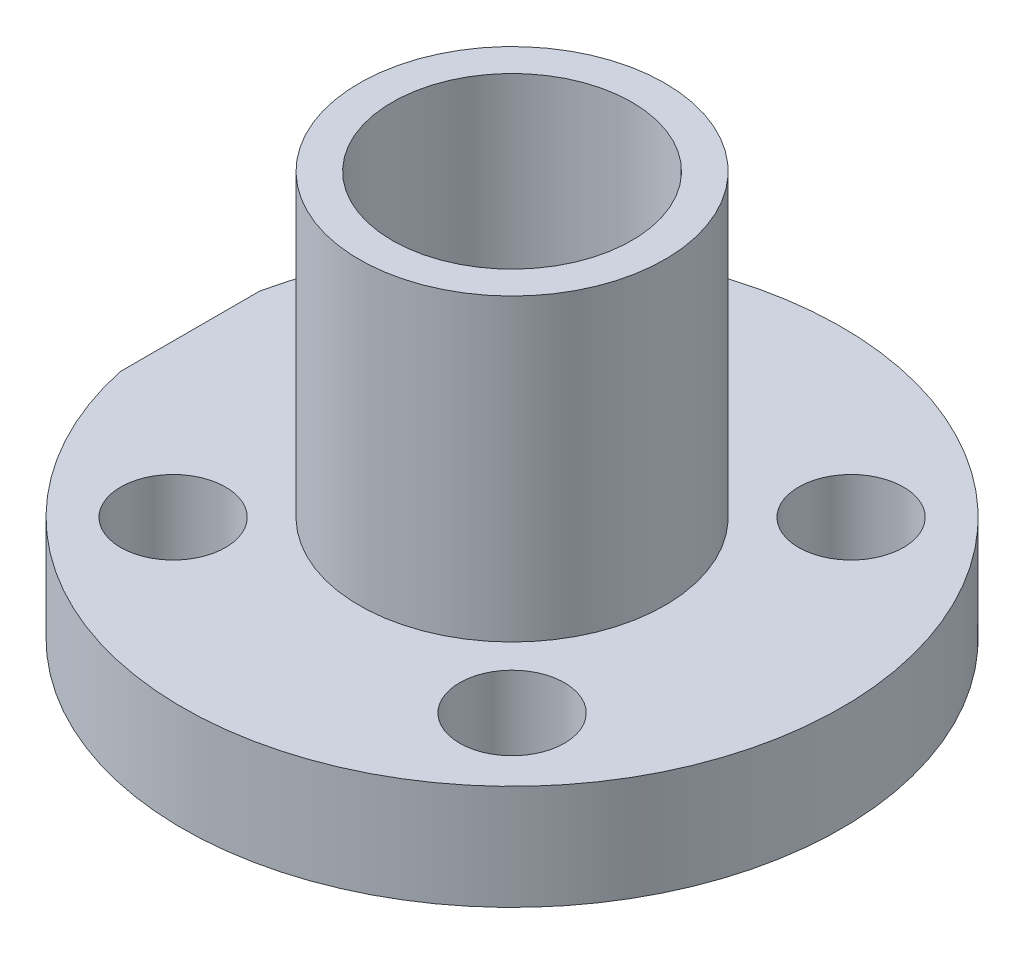
ISO-10303-21;
HEADER;
FILE_DESCRIPTION(('STEP AP214'),'2;1');
FILE_NAME('part.step','',(''),(''),'','','');
FILE_SCHEMA(('AUTOMOTIVE_DESIGN { 1 0 10303 214 1 1 1 1 }'));
ENDSEC;
DATA;
#1=APPLICATION_CONTEXT('core data for automotive mechanical design processes');
#2=APPLICATION_PROTOCOL_DEFINITION('international standard','automotive_design',2000,#1);
#3=PRODUCT_CONTEXT('',#1,'mechanical');
#4=PRODUCT('Part','Part','',(#3));
#5=PRODUCT_RELATED_PRODUCT_CATEGORY('part','',(#4));
#6=PRODUCT_DEFINITION_FORMATION('','',#4);
#7=PRODUCT_DEFINITION_CONTEXT('part definition',#1,'design');
#8=PRODUCT_DEFINITION('design','',#6,#7);
#9=PRODUCT_DEFINITION_SHAPE('','',#8);
#10=(LENGTH_UNIT() NAMED_UNIT(*) SI_UNIT(.MILLI.,.METRE.));
#11=(NAMED_UNIT(*) PLANE_ANGLE_UNIT() SI_UNIT($,.RADIAN.));
#12=(NAMED_UNIT(*) SI_UNIT($,.STERADIAN.) SOLID_ANGLE_UNIT());
#13=UNCERTAINTY_MEASURE_WITH_UNIT(LENGTH_MEASURE(1.E-05),#10,'distance_accuracy_value','');
#14=(GEOMETRIC_REPRESENTATION_CONTEXT(3) GLOBAL_UNCERTAINTY_ASSIGNED_CONTEXT((#13)) GLOBAL_UNIT_ASSIGNED_CONTEXT((#10,
#11,#12)) REPRESENTATION_CONTEXT('',''));
#15=CARTESIAN_POINT('',(0.,0.,0.));
#16=DIRECTION('',(0.,0.,1.));
#17=DIRECTION('',(1.,0.,0.));
#18=AXIS2_PLACEMENT_3D('',#15,#16,#17);
#19=CARTESIAN_POINT('',(0.,0.,0.));
#20=DIRECTION('',(0.,-1.,0.));
#21=DIRECTION('',(0.,0.,-1.));
#22=AXIS2_PLACEMENT_3D('',#19,#20,#21);
#23=CYLINDRICAL_SURFACE('',#22,4.);
#24=CARTESIAN_POINT('',(0.,13.5,0.));
#25=DIRECTION('',(0.,-1.,0.));
#26=DIRECTION('',(0.,0.,-1.));
#27=AXIS2_PLACEMENT_3D('',#24,#25,#26);
#28=CIRCLE('',#27,4.);
#29=CARTESIAN_POINT('',(0.,13.5,-4.));
#30=VERTEX_POINT('',#29);
#31=EDGE_CURVE('E42',#30,#30,#28,.T.);
#32=ORIENTED_EDGE('',*,*,#31,.F.);
#33=EDGE_LOOP('',(#32));
#34=FACE_BOUND('',#33,.T.);
#35=CARTESIAN_POINT('',(0.,-1.5,0.));
#36=DIRECTION('',(0.,-1.,0.));
#37=DIRECTION('',(0.,0.,-1.));
#38=AXIS2_PLACEMENT_3D('',#35,#36,#37);
#39=CIRCLE('',#38,4.);
#40=CARTESIAN_POINT('',(0.,-1.5,-4.));
#41=VERTEX_POINT('',#40);
#42=EDGE_CURVE('E114',#41,#41,#39,.T.);
#43=ORIENTED_EDGE('',*,*,#42,.T.);
#44=EDGE_LOOP('',(#43));
#45=FACE_BOUND('',#44,.T.);
#46=ADVANCED_FACE('F35',(#34,#45),#23,.F.);
#47=CARTESIAN_POINT('',(-4.,13.5,0.));
#48=DIRECTION('',(0.,-1.,0.));
#49=DIRECTION('',(0.,0.,-1.));
#50=AXIS2_PLACEMENT_3D('',#47,#48,#49);
#51=PLANE('',#50);
#52=CARTESIAN_POINT('',(0.,13.5,0.));
#53=DIRECTION('',(0.,-1.,0.));
#54=DIRECTION('',(0.,0.,-1.));
#55=AXIS2_PLACEMENT_3D('',#52,#53,#54);
#56=CIRCLE('',#55,5.1);
#57=CARTESIAN_POINT('',(0.,13.5,-5.1));
#58=VERTEX_POINT('',#57);
#59=EDGE_CURVE('E77',#58,#58,#56,.T.);
#60=ORIENTED_EDGE('',*,*,#59,.F.);
#61=EDGE_LOOP('',(#60));
#62=FACE_BOUND('',#61,.T.);
#63=ORIENTED_EDGE('',*,*,#31,.T.);
#64=EDGE_LOOP('',(#63));
#65=FACE_BOUND('',#64,.T.);
#66=ADVANCED_FACE('F139',(#62,#65),#51,.F.);
#67=CARTESIAN_POINT('',(0.,0.,0.));
#68=DIRECTION('',(0.,-1.,0.));
#69=DIRECTION('',(0.,0.,-1.));
#70=AXIS2_PLACEMENT_3D('',#67,#68,#69);
#71=CYLINDRICAL_SURFACE('',#70,5.1);
#72=CARTESIAN_POINT('',(0.,3.5,0.));
#73=DIRECTION('',(0.,-1.,0.));
#74=DIRECTION('',(0.,0.,-1.));
#75=AXIS2_PLACEMENT_3D('',#72,#73,#74);
#76=CIRCLE('',#75,5.1);
#77=CARTESIAN_POINT('',(0.,3.5,-5.1));
#78=VERTEX_POINT('',#77);
#79=EDGE_CURVE('E73',#78,#78,#76,.T.);
#80=ORIENTED_EDGE('',*,*,#79,.F.);
#81=EDGE_LOOP('',(#80));
#82=FACE_BOUND('',#81,.T.);
#83=ORIENTED_EDGE('',*,*,#59,.T.);
#84=EDGE_LOOP('',(#83));
#85=FACE_BOUND('',#84,.T.);
#86=ADVANCED_FACE('F144',(#82,#85),#71,.T.);
#87=CARTESIAN_POINT('',(-5.1,3.5,0.));
#88=DIRECTION('',(0.,-1.,0.));
#89=DIRECTION('',(0.,0.,-1.));
#90=AXIS2_PLACEMENT_3D('',#87,#88,#89);
#91=PLANE('',#90);
#92=CARTESIAN_POINT('',(-5.65685424949238,3.5,-5.65685424949238));
#93=DIRECTION('',(0.,1.,0.));
#94=DIRECTION('',(0.,0.,1.));
#95=AXIS2_PLACEMENT_3D('',#92,#93,#94);
#96=CIRCLE('',#95,1.75);
#97=CARTESIAN_POINT('',(-5.65685424949238,3.5,-3.90685424949238));
#98=VERTEX_POINT('',#97);
#99=EDGE_CURVE('E64',#98,#98,#96,.T.);
#100=ORIENTED_EDGE('',*,*,#99,.F.);
#101=EDGE_LOOP('',(#100));
#102=FACE_BOUND('',#101,.T.);
#103=CARTESIAN_POINT('',(5.65685424949238,3.5,5.65685424949238));
#104=DIRECTION('',(0.,1.,0.));
#105=DIRECTION('',(0.,0.,1.));
#106=AXIS2_PLACEMENT_3D('',#103,#104,#105);
#107=CIRCLE('',#106,1.75);
#108=CARTESIAN_POINT('',(5.65685424949238,3.5,7.40685424949238));
#109=VERTEX_POINT('',#108);
#110=EDGE_CURVE('E90',#109,#109,#107,.T.);
#111=ORIENTED_EDGE('',*,*,#110,.F.);
#112=EDGE_LOOP('',(#111));
#113=FACE_BOUND('',#112,.T.);
#114=CARTESIAN_POINT('',(-5.65685424949238,3.5,5.65685424949238));
#115=DIRECTION('',(0.,1.,0.));
#116=DIRECTION('',(0.,0.,1.));
#117=AXIS2_PLACEMENT_3D('',#114,#115,#116);
#118=CIRCLE('',#117,1.75);
#119=CARTESIAN_POINT('',(-5.65685424949238,3.5,7.40685424949238));
#120=VERTEX_POINT('',#119);
#121=EDGE_CURVE('E89',#120,#120,#118,.T.);
#122=ORIENTED_EDGE('',*,*,#121,.F.);
#123=EDGE_LOOP('',(#122));
#124=FACE_BOUND('',#123,.T.);
#125=CARTESIAN_POINT('',(5.65685424949238,3.5,-5.65685424949238));
#126=DIRECTION('',(0.,1.,0.));
#127=DIRECTION('',(0.,0.,1.));
#128=AXIS2_PLACEMENT_3D('',#125,#126,#127);
#129=CIRCLE('',#128,1.75);
#130=CARTESIAN_POINT('',(5.65685424949238,3.5,-3.90685424949238));
#131=VERTEX_POINT('',#130);
#132=EDGE_CURVE('E108',#131,#131,#129,.T.);
#133=ORIENTED_EDGE('',*,*,#132,.F.);
#134=EDGE_LOOP('',(#133));
#135=FACE_BOUND('',#134,.T.);
#136=CARTESIAN_POINT('',(0.,3.5,0.));
#137=DIRECTION('',(0.,-1.,0.));
#138=DIRECTION('',(0.,0.,-1.));
#139=AXIS2_PLACEMENT_3D('',#136,#137,#138);
#140=CIRCLE('',#139,11.);
#141=CARTESIAN_POINT('',(-10.75,3.5,-2.3318447632722));
#142=VERTEX_POINT('',#141);
#143=CARTESIAN_POINT('',(-10.75,3.5,2.3318447632722));
#144=VERTEX_POINT('',#143);
#145=EDGE_CURVE('E70',#142,#144,#140,.T.);
#146=ORIENTED_EDGE('',*,*,#145,.F.);
#147=DIRECTION('',(0.,0.,-1.));
#148=VECTOR('',#147,1.);
#149=CARTESIAN_POINT('',(-10.75,3.5,25.));
#150=LINE('',#149,#148);
#151=EDGE_CURVE('E59',#144,#142,#150,.T.);
#152=ORIENTED_EDGE('',*,*,#151,.F.);
#153=EDGE_LOOP('',(#146,#152));
#154=FACE_BOUND('',#153,.T.);
#155=ORIENTED_EDGE('',*,*,#79,.T.);
#156=EDGE_LOOP('',(#155));
#157=FACE_BOUND('',#156,.T.);
#158=ADVANCED_FACE('F68',(#102,#113,#124,#135,#154,#157),#91,.F.);
#159=CARTESIAN_POINT('',(0.,0.,0.));
#160=DIRECTION('',(0.,-1.,0.));
#161=DIRECTION('',(0.,0.,-1.));
#162=AXIS2_PLACEMENT_3D('',#159,#160,#161);
#163=CYLINDRICAL_SURFACE('',#162,11.);
#164=ORIENTED_EDGE('',*,*,#145,.T.);
#165=DIRECTION('',(0.,-1.,0.));
#166=VECTOR('',#165,1.);
#167=CARTESIAN_POINT('',(-10.75,0.,2.3318447632722));
#168=LINE('',#167,#166);
#169=CARTESIAN_POINT('',(-10.75,0.,2.3318447632722));
#170=VERTEX_POINT('',#169);
#171=EDGE_CURVE('E56',#144,#170,#168,.T.);
#172=ORIENTED_EDGE('',*,*,#171,.T.);
#173=CARTESIAN_POINT('',(0.,0.,0.));
#174=DIRECTION('',(0.,-1.,0.));
#175=DIRECTION('',(0.,0.,-1.));
#176=AXIS2_PLACEMENT_3D('',#173,#174,#175);
#177=CIRCLE('',#176,11.);
#178=CARTESIAN_POINT('',(-10.75,0.,-2.3318447632722));
#179=VERTEX_POINT('',#178);
#180=EDGE_CURVE('E74',#179,#170,#177,.T.);
#181=ORIENTED_EDGE('',*,*,#180,.F.);
#182=DIRECTION('',(0.,-1.,0.));
#183=VECTOR('',#182,1.);
#184=CARTESIAN_POINT('',(-10.75,0.,-2.3318447632722));
#185=LINE('',#184,#183);
#186=EDGE_CURVE('E49',#179,#142,#185,.F.);
#187=ORIENTED_EDGE('',*,*,#186,.T.);
#188=EDGE_LOOP('',(#164,#172,#181,#187));
#189=FACE_BOUND('',#188,.T.);
#190=ADVANCED_FACE('F72',(#189),#163,.T.);
#191=CARTESIAN_POINT('',(-11.,0.,0.));
#192=DIRECTION('',(0.,1.,0.));
#193=DIRECTION('',(0.,0.,1.));
#194=AXIS2_PLACEMENT_3D('',#191,#192,#193);
#195=PLANE('',#194);
#196=CARTESIAN_POINT('',(-5.65685424949238,0.,-5.65685424949238));
#197=DIRECTION('',(0.,1.,0.));
#198=DIRECTION('',(0.,0.,1.));
#199=AXIS2_PLACEMENT_3D('',#196,#197,#198);
#200=CIRCLE('',#199,1.75);
#201=CARTESIAN_POINT('',(-5.65685424949238,0.,-3.90685424949238));
#202=VERTEX_POINT('',#201);
#203=EDGE_CURVE('E91',#202,#202,#200,.T.);
#204=ORIENTED_EDGE('',*,*,#203,.T.);
#205=EDGE_LOOP('',(#204));
#206=FACE_BOUND('',#205,.T.);
#207=CARTESIAN_POINT('',(5.65685424949238,0.,5.65685424949238));
#208=DIRECTION('',(0.,1.,0.));
#209=DIRECTION('',(0.,0.,1.));
#210=AXIS2_PLACEMENT_3D('',#207,#208,#209);
#211=CIRCLE('',#210,1.75);
#212=CARTESIAN_POINT('',(5.65685424949238,0.,7.40685424949238));
#213=VERTEX_POINT('',#212);
#214=EDGE_CURVE('E87',#213,#213,#211,.T.);
#215=ORIENTED_EDGE('',*,*,#214,.T.);
#216=EDGE_LOOP('',(#215));
#217=FACE_BOUND('',#216,.T.);
#218=CARTESIAN_POINT('',(-5.65685424949238,0.,5.65685424949238));
#219=DIRECTION('',(0.,1.,0.));
#220=DIRECTION('',(0.,0.,1.));
#221=AXIS2_PLACEMENT_3D('',#218,#219,#220);
#222=CIRCLE('',#221,1.75);
#223=CARTESIAN_POINT('',(-5.65685424949238,0.,7.40685424949238));
#224=VERTEX_POINT('',#223);
#225=EDGE_CURVE('E105',#224,#224,#222,.T.);
#226=ORIENTED_EDGE('',*,*,#225,.T.);
#227=EDGE_LOOP('',(#226));
#228=FACE_BOUND('',#227,.T.);
#229=CARTESIAN_POINT('',(5.65685424949238,0.,-5.65685424949238));
#230=DIRECTION('',(0.,1.,0.));
#231=DIRECTION('',(0.,0.,1.));
#232=AXIS2_PLACEMENT_3D('',#229,#230,#231);
#233=CIRCLE('',#232,1.75);
#234=CARTESIAN_POINT('',(5.65685424949238,0.,-3.90685424949238));
#235=VERTEX_POINT('',#234);
#236=EDGE_CURVE('E111',#235,#235,#233,.T.);
#237=ORIENTED_EDGE('',*,*,#236,.T.);
#238=EDGE_LOOP('',(#237));
#239=FACE_BOUND('',#238,.T.);
#240=CARTESIAN_POINT('',(0.,0.,0.));
#241=DIRECTION('',(0.,-1.,0.));
#242=DIRECTION('',(0.,0.,-1.));
#243=AXIS2_PLACEMENT_3D('',#240,#241,#242);
#244=CIRCLE('',#243,5.1);
#245=CARTESIAN_POINT('',(0.,0.,-5.1));
#246=VERTEX_POINT('',#245);
#247=EDGE_CURVE('E79',#246,#246,#244,.T.);
#248=ORIENTED_EDGE('',*,*,#247,.F.);
#249=EDGE_LOOP('',(#248));
#250=FACE_BOUND('',#249,.T.);
#251=ORIENTED_EDGE('',*,*,#180,.T.);
#252=DIRECTION('',(0.,0.,-1.));
#253=VECTOR('',#252,1.);
#254=CARTESIAN_POINT('',(-10.75,0.,0.));
#255=LINE('',#254,#253);
#256=EDGE_CURVE('E11',#170,#179,#255,.T.);
#257=ORIENTED_EDGE('',*,*,#256,.T.);
#258=EDGE_LOOP('',(#251,#257));
#259=FACE_BOUND('',#258,.T.);
#260=ADVANCED_FACE('F124',(#206,#217,#228,#239,#250,#259),#195,.F.);
#261=CARTESIAN_POINT('',(0.,0.,0.));
#262=DIRECTION('',(0.,-1.,0.));
#263=DIRECTION('',(0.,0.,-1.));
#264=AXIS2_PLACEMENT_3D('',#261,#262,#263);
#265=CYLINDRICAL_SURFACE('',#264,5.1);
#266=CARTESIAN_POINT('',(0.,-1.5,0.));
#267=DIRECTION('',(0.,-1.,0.));
#268=DIRECTION('',(0.,0.,-1.));
#269=AXIS2_PLACEMENT_3D('',#266,#267,#268);
#270=CIRCLE('',#269,5.1);
#271=CARTESIAN_POINT('',(0.,-1.5,-5.1));
#272=VERTEX_POINT('',#271);
#273=EDGE_CURVE('E117',#272,#272,#270,.T.);
#274=ORIENTED_EDGE('',*,*,#273,.F.);
#275=EDGE_LOOP('',(#274));
#276=FACE_BOUND('',#275,.T.);
#277=ORIENTED_EDGE('',*,*,#247,.T.);
#278=EDGE_LOOP('',(#277));
#279=FACE_BOUND('',#278,.T.);
#280=ADVANCED_FACE('F122',(#276,#279),#265,.T.);
#281=CARTESIAN_POINT('',(-5.1,-1.5,0.));
#282=DIRECTION('',(0.,1.,0.));
#283=DIRECTION('',(0.,0.,1.));
#284=AXIS2_PLACEMENT_3D('',#281,#282,#283);
#285=PLANE('',#284);
#286=ORIENTED_EDGE('',*,*,#42,.F.);
#287=EDGE_LOOP('',(#286));
#288=FACE_BOUND('',#287,.T.);
#289=ORIENTED_EDGE('',*,*,#273,.T.);
#290=EDGE_LOOP('',(#289));
#291=FACE_BOUND('',#290,.T.);
#292=ADVANCED_FACE('F133',(#288,#291),#285,.F.);
#293=CARTESIAN_POINT('',(5.65685424949238,3.5,-5.65685424949238));
#294=DIRECTION('',(0.,1.,0.));
#295=DIRECTION('',(0.,0.,1.));
#296=AXIS2_PLACEMENT_3D('',#293,#294,#295);
#297=CYLINDRICAL_SURFACE('',#296,1.75);
#298=ORIENTED_EDGE('',*,*,#132,.T.);
#299=EDGE_LOOP('',(#298));
#300=FACE_BOUND('',#299,.T.);
#301=ORIENTED_EDGE('',*,*,#236,.F.);
#302=EDGE_LOOP('',(#301));
#303=FACE_BOUND('',#302,.T.);
#304=ADVANCED_FACE('F152',(#300,#303),#297,.F.);
#305=CARTESIAN_POINT('',(-5.65685424949238,3.5,5.65685424949238));
#306=DIRECTION('',(0.,1.,0.));
#307=DIRECTION('',(0.,0.,1.));
#308=AXIS2_PLACEMENT_3D('',#305,#306,#307);
#309=CYLINDRICAL_SURFACE('',#308,1.75);
#310=ORIENTED_EDGE('',*,*,#121,.T.);
#311=EDGE_LOOP('',(#310));
#312=FACE_BOUND('',#311,.T.);
#313=ORIENTED_EDGE('',*,*,#225,.F.);
#314=EDGE_LOOP('',(#313));
#315=FACE_BOUND('',#314,.T.);
#316=ADVANCED_FACE('F158',(#312,#315),#309,.F.);
#317=CARTESIAN_POINT('',(5.65685424949238,3.5,5.65685424949238));
#318=DIRECTION('',(0.,1.,0.));
#319=DIRECTION('',(0.,0.,1.));
#320=AXIS2_PLACEMENT_3D('',#317,#318,#319);
#321=CYLINDRICAL_SURFACE('',#320,1.75);
#322=ORIENTED_EDGE('',*,*,#110,.T.);
#323=EDGE_LOOP('',(#322));
#324=FACE_BOUND('',#323,.T.);
#325=ORIENTED_EDGE('',*,*,#214,.F.);
#326=EDGE_LOOP('',(#325));
#327=FACE_BOUND('',#326,.T.);
#328=ADVANCED_FACE('F164',(#324,#327),#321,.F.);
#329=CARTESIAN_POINT('',(-5.65685424949238,3.5,-5.65685424949238));
#330=DIRECTION('',(0.,1.,0.));
#331=DIRECTION('',(0.,0.,1.));
#332=AXIS2_PLACEMENT_3D('',#329,#330,#331);
#333=CYLINDRICAL_SURFACE('',#332,1.75);
#334=ORIENTED_EDGE('',*,*,#99,.T.);
#335=EDGE_LOOP('',(#334));
#336=FACE_BOUND('',#335,.T.);
#337=ORIENTED_EDGE('',*,*,#203,.F.);
#338=EDGE_LOOP('',(#337));
#339=FACE_BOUND('',#338,.T.);
#340=ADVANCED_FACE('F168',(#336,#339),#333,.F.);
#341=CARTESIAN_POINT('',(-10.75,-1.5,25.));
#342=DIRECTION('',(1.,0.,0.));
#343=DIRECTION('',(0.,0.,-1.));
#344=AXIS2_PLACEMENT_3D('',#341,#342,#343);
#345=PLANE('',#344);
#346=ORIENTED_EDGE('',*,*,#151,.T.);
#347=ORIENTED_EDGE('',*,*,#186,.F.);
#348=ORIENTED_EDGE('',*,*,#256,.F.);
#349=ORIENTED_EDGE('',*,*,#171,.F.);
#350=EDGE_LOOP('',(#346,#347,#348,#349));
#351=FACE_BOUND('',#350,.T.);
#352=ADVANCED_FACE('F58',(#351),#345,.F.);
#353=CLOSED_SHELL('',(#46,#66,#86,#158,#190,#260,#280,#292,#304,#316,#328,#340,#352));
#354=MANIFOLD_SOLID_BREP('B2',#353);
#355=ADVANCED_BREP_SHAPE_REPRESENTATION('',(#18,#354),#14);
#356=SHAPE_DEFINITION_REPRESENTATION(#9,#355);
ENDSEC;
END-ISO-10303-21;
